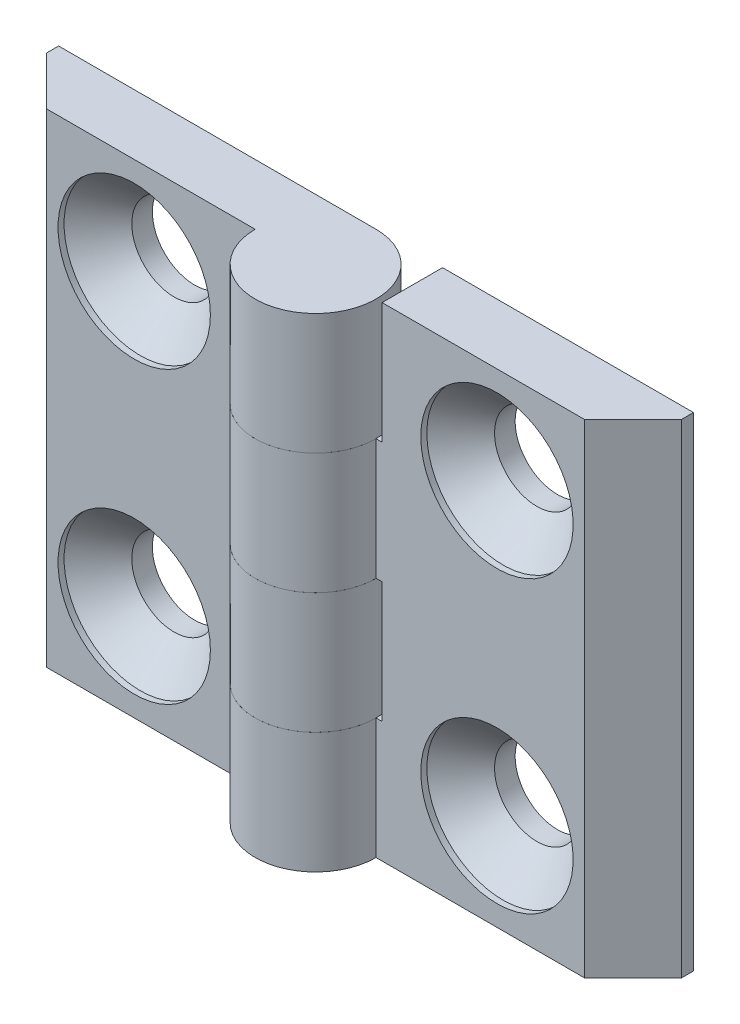
ISO-10303-21;
HEADER;
FILE_DESCRIPTION(('STEP AP214'),'2;1');
FILE_NAME('part.step','',(''),(''),'','','');
FILE_SCHEMA(('AUTOMOTIVE_DESIGN { 1 0 10303 214 1 1 1 1 }'));
ENDSEC;
DATA;
#1=APPLICATION_CONTEXT('core data for automotive mechanical design processes');
#2=APPLICATION_PROTOCOL_DEFINITION('international standard','automotive_design',2000,#1);
#3=PRODUCT_CONTEXT('',#1,'mechanical');
#4=PRODUCT('Part','Part','',(#3));
#5=PRODUCT_RELATED_PRODUCT_CATEGORY('part','',(#4));
#6=PRODUCT_DEFINITION_FORMATION('','',#4);
#7=PRODUCT_DEFINITION_CONTEXT('part definition',#1,'design');
#8=PRODUCT_DEFINITION('design','',#6,#7);
#9=PRODUCT_DEFINITION_SHAPE('','',#8);
#10=(LENGTH_UNIT() NAMED_UNIT(*) SI_UNIT(.MILLI.,.METRE.));
#11=(NAMED_UNIT(*) PLANE_ANGLE_UNIT() SI_UNIT($,.RADIAN.));
#12=(NAMED_UNIT(*) SI_UNIT($,.STERADIAN.) SOLID_ANGLE_UNIT());
#13=UNCERTAINTY_MEASURE_WITH_UNIT(LENGTH_MEASURE(1.E-05),#10,'distance_accuracy_value','');
#14=(GEOMETRIC_REPRESENTATION_CONTEXT(3) GLOBAL_UNCERTAINTY_ASSIGNED_CONTEXT((#13)) GLOBAL_UNIT_ASSIGNED_CONTEXT((#10,
#11,#12)) REPRESENTATION_CONTEXT('',''));
#15=CARTESIAN_POINT('',(0.,0.,0.));
#16=DIRECTION('',(0.,0.,1.));
#17=DIRECTION('',(1.,0.,0.));
#18=AXIS2_PLACEMENT_3D('',#15,#16,#17);
#19=CARTESIAN_POINT('',(0.,-20.,0.));
#20=DIRECTION('',(0.,1.,0.));
#21=DIRECTION('',(0.,0.,-1.));
#22=AXIS2_PLACEMENT_3D('',#19,#20,#21);
#23=CYLINDRICAL_SURFACE('',#22,5.);
#24=DIRECTION('',(0.,1.,0.));
#25=VECTOR('',#24,1.);
#26=CARTESIAN_POINT('',(5.,-20.,0.));
#27=LINE('',#26,#25);
#28=CARTESIAN_POINT('',(5.,-20.,0.));
#29=VERTEX_POINT('',#28);
#30=CARTESIAN_POINT('',(5.,-10.,0.));
#31=VERTEX_POINT('',#30);
#32=EDGE_CURVE('E194',#29,#31,#27,.T.);
#33=ORIENTED_EDGE('',*,*,#32,.T.);
#34=CARTESIAN_POINT('',(0.,-10.,0.));
#35=DIRECTION('',(0.,-1.,0.));
#36=DIRECTION('',(0.,0.,1.));
#37=AXIS2_PLACEMENT_3D('',#34,#35,#36);
#38=CIRCLE('',#37,5.);
#39=CARTESIAN_POINT('',(0.,-10.,-5.));
#40=VERTEX_POINT('',#39);
#41=EDGE_CURVE('E171',#31,#40,#38,.T.);
#42=ORIENTED_EDGE('',*,*,#41,.T.);
#43=DIRECTION('',(0.,1.,0.));
#44=VECTOR('',#43,1.);
#45=CARTESIAN_POINT('',(0.,-20.,-5.));
#46=LINE('',#45,#44);
#47=CARTESIAN_POINT('',(0.,-20.,-5.));
#48=VERTEX_POINT('',#47);
#49=EDGE_CURVE('E207',#48,#40,#46,.T.);
#50=ORIENTED_EDGE('',*,*,#49,.F.);
#51=CARTESIAN_POINT('',(0.,-20.,0.));
#52=DIRECTION('',(0.,-1.,0.));
#53=DIRECTION('',(0.,0.,1.));
#54=AXIS2_PLACEMENT_3D('',#51,#52,#53);
#55=CIRCLE('',#54,5.);
#56=EDGE_CURVE('E174',#29,#48,#55,.T.);
#57=ORIENTED_EDGE('',*,*,#56,.F.);
#58=EDGE_LOOP('',(#33,#42,#50,#57));
#59=FACE_BOUND('',#58,.T.);
#60=ADVANCED_FACE('F45',(#59),#23,.T.);
#61=CARTESIAN_POINT('',(0.,0.,-5.));
#62=VERTEX_POINT('',#61);
#63=CARTESIAN_POINT('',(0.,10.,-5.));
#64=VERTEX_POINT('',#63);
#65=EDGE_CURVE('E206',#62,#64,#46,.T.);
#66=ORIENTED_EDGE('',*,*,#65,.F.);
#67=CARTESIAN_POINT('',(0.,0.,0.));
#68=DIRECTION('',(0.,1.,0.));
#69=DIRECTION('',(0.,0.,-1.));
#70=AXIS2_PLACEMENT_3D('',#67,#68,#69);
#71=CIRCLE('',#70,5.);
#72=CARTESIAN_POINT('',(5.,0.,0.));
#73=VERTEX_POINT('',#72);
#74=EDGE_CURVE('E142',#62,#73,#71,.T.);
#75=ORIENTED_EDGE('',*,*,#74,.T.);
#76=CARTESIAN_POINT('',(5.,10.,0.));
#77=VERTEX_POINT('',#76);
#78=EDGE_CURVE('E186',#73,#77,#27,.T.);
#79=ORIENTED_EDGE('',*,*,#78,.T.);
#80=CARTESIAN_POINT('',(0.,10.,0.));
#81=DIRECTION('',(0.,-1.,0.));
#82=DIRECTION('',(1.,0.,0.));
#83=AXIS2_PLACEMENT_3D('',#80,#81,#82);
#84=CIRCLE('',#83,5.);
#85=EDGE_CURVE('E168',#77,#64,#84,.T.);
#86=ORIENTED_EDGE('',*,*,#85,.T.);
#87=EDGE_LOOP('',(#66,#75,#79,#86));
#88=FACE_BOUND('',#87,.T.);
#89=ADVANCED_FACE('F47',(#88),#23,.T.);
#90=CARTESIAN_POINT('',(0.,-20.,-5.));
#91=DIRECTION('',(0.,0.,1.));
#92=DIRECTION('',(-1.,0.,0.));
#93=AXIS2_PLACEMENT_3D('',#90,#91,#92);
#94=PLANE('',#93);
#95=CARTESIAN_POINT('',(15.,-12.,-5.00000000000011));
#96=DIRECTION('',(0.,0.,1.));
#97=DIRECTION('',(-1.,0.,0.));
#98=AXIS2_PLACEMENT_3D('',#95,#96,#97);
#99=CIRCLE('',#98,3.5);
#100=CARTESIAN_POINT('',(11.5,-12.,-5.00000000000009));
#101=VERTEX_POINT('',#100);
#102=EDGE_CURVE('E377',#101,#101,#99,.T.);
#103=ORIENTED_EDGE('',*,*,#102,.T.);
#104=EDGE_LOOP('',(#103));
#105=FACE_BOUND('',#104,.T.);
#106=CARTESIAN_POINT('',(15.,12.,-5.00000000000011));
#107=DIRECTION('',(0.,0.,1.));
#108=DIRECTION('',(-1.,0.,0.));
#109=AXIS2_PLACEMENT_3D('',#106,#107,#108);
#110=CIRCLE('',#109,3.5);
#111=CARTESIAN_POINT('',(11.5,12.,-5.00000000000009));
#112=VERTEX_POINT('',#111);
#113=EDGE_CURVE('E155',#112,#112,#110,.T.);
#114=ORIENTED_EDGE('',*,*,#113,.T.);
#115=EDGE_LOOP('',(#114));
#116=FACE_BOUND('',#115,.T.);
#117=ORIENTED_EDGE('',*,*,#49,.T.);
#118=DIRECTION('',(1.,0.,0.));
#119=VECTOR('',#118,1.);
#120=CARTESIAN_POINT('',(5.49999999999996,-10.,-5.00000000000004));
#121=LINE('',#120,#119);
#122=CARTESIAN_POINT('',(5.49999999999996,-10.,-5.00000000000004));
#123=VERTEX_POINT('',#122);
#124=EDGE_CURVE('E137',#40,#123,#121,.T.);
#125=ORIENTED_EDGE('',*,*,#124,.T.);
#126=DIRECTION('',(0.,1.,0.));
#127=VECTOR('',#126,1.);
#128=CARTESIAN_POINT('',(5.49999999999996,-10.,-5.00000000000004));
#129=LINE('',#128,#127);
#130=CARTESIAN_POINT('',(5.49999999999996,0.,-5.00000000000004));
#131=VERTEX_POINT('',#130);
#132=EDGE_CURVE('E132',#123,#131,#129,.T.);
#133=ORIENTED_EDGE('',*,*,#132,.T.);
#134=DIRECTION('',(-1.,0.,0.));
#135=VECTOR('',#134,1.);
#136=CARTESIAN_POINT('',(5.49999999999996,0.,-5.00000000000004));
#137=LINE('',#136,#135);
#138=EDGE_CURVE('E140',#131,#62,#137,.T.);
#139=ORIENTED_EDGE('',*,*,#138,.T.);
#140=ORIENTED_EDGE('',*,*,#65,.T.);
#141=DIRECTION('',(1.,0.,0.));
#142=VECTOR('',#141,1.);
#143=CARTESIAN_POINT('',(-5.00000000000004,10.,-4.99999999999996));
#144=LINE('',#143,#142);
#145=CARTESIAN_POINT('',(5.49999999999996,10.,-5.00000000000004));
#146=VERTEX_POINT('',#145);
#147=EDGE_CURVE('E160',#64,#146,#144,.T.);
#148=ORIENTED_EDGE('',*,*,#147,.T.);
#149=DIRECTION('',(0.,1.,0.));
#150=VECTOR('',#149,1.);
#151=CARTESIAN_POINT('',(5.49999999999996,20.,-5.00000000000004));
#152=LINE('',#151,#150);
#153=CARTESIAN_POINT('',(5.49999999999996,20.,-5.00000000000004));
#154=VERTEX_POINT('',#153);
#155=EDGE_CURVE('E163',#146,#154,#152,.T.);
#156=ORIENTED_EDGE('',*,*,#155,.T.);
#157=DIRECTION('',(1.,0.,0.));
#158=VECTOR('',#157,1.);
#159=CARTESIAN_POINT('',(0.,20.,-5.));
#160=LINE('',#159,#158);
#161=CARTESIAN_POINT('',(26.25,20.,-5.00000000000019));
#162=VERTEX_POINT('',#161);
#163=EDGE_CURVE('E173',#154,#162,#160,.T.);
#164=ORIENTED_EDGE('',*,*,#163,.T.);
#165=DIRECTION('',(0.,1.,0.));
#166=VECTOR('',#165,1.);
#167=CARTESIAN_POINT('',(26.25,-20.,-5.00000000000019));
#168=LINE('',#167,#166);
#169=CARTESIAN_POINT('',(26.25,-20.,-5.00000000000019));
#170=VERTEX_POINT('',#169);
#171=EDGE_CURVE('E203',#170,#162,#168,.T.);
#172=ORIENTED_EDGE('',*,*,#171,.F.);
#173=DIRECTION('',(1.,0.,0.));
#174=VECTOR('',#173,1.);
#175=CARTESIAN_POINT('',(0.,-20.,-5.));
#176=LINE('',#175,#174);
#177=EDGE_CURVE('E177',#48,#170,#176,.T.);
#178=ORIENTED_EDGE('',*,*,#177,.F.);
#179=EDGE_LOOP('',(#117,#125,#133,#139,#140,#148,#156,#164,#172,#178));
#180=FACE_BOUND('',#179,.T.);
#181=ADVANCED_FACE('F148',(#105,#116,#180),#94,.F.);
#182=CARTESIAN_POINT('',(26.25,-20.,-5.00000000000019));
#183=DIRECTION('',(-1.,0.,0.));
#184=DIRECTION('',(0.,0.,-1.));
#185=AXIS2_PLACEMENT_3D('',#182,#183,#184);
#186=PLANE('',#185);
#187=DIRECTION('',(0.,0.,1.));
#188=VECTOR('',#187,1.);
#189=CARTESIAN_POINT('',(26.25,20.,-5.00000000000019));
#190=LINE('',#189,#188);
#191=CARTESIAN_POINT('',(26.25,20.,-4.00000000000019));
#192=VERTEX_POINT('',#191);
#193=EDGE_CURVE('E188',#162,#192,#190,.T.);
#194=ORIENTED_EDGE('',*,*,#193,.T.);
#195=DIRECTION('',(0.,1.,0.));
#196=VECTOR('',#195,1.);
#197=CARTESIAN_POINT('',(26.25,-20.,-4.00000000000019));
#198=LINE('',#197,#196);
#199=CARTESIAN_POINT('',(26.25,-20.,-4.00000000000019));
#200=VERTEX_POINT('',#199);
#201=EDGE_CURVE('E200',#200,#192,#198,.T.);
#202=ORIENTED_EDGE('',*,*,#201,.F.);
#203=DIRECTION('',(0.,0.,1.));
#204=VECTOR('',#203,1.);
#205=CARTESIAN_POINT('',(26.25,-20.,-5.00000000000019));
#206=LINE('',#205,#204);
#207=EDGE_CURVE('E180',#170,#200,#206,.T.);
#208=ORIENTED_EDGE('',*,*,#207,.F.);
#209=ORIENTED_EDGE('',*,*,#171,.T.);
#210=EDGE_LOOP('',(#194,#202,#208,#209));
#211=FACE_BOUND('',#210,.T.);
#212=ADVANCED_FACE('F237',(#211),#186,.F.);
#213=CARTESIAN_POINT('',(26.25,-20.,-4.00000000000019));
#214=DIRECTION('',(-0.707106781186549,0.,-0.707106781186546));
#215=DIRECTION('',(0.707106781186546,0.,-0.707106781186549));
#216=AXIS2_PLACEMENT_3D('',#213,#214,#215);
#217=PLANE('',#216);
#218=DIRECTION('',(-0.707106781186546,0.,0.707106781186549));
#219=VECTOR('',#218,1.);
#220=CARTESIAN_POINT('',(26.25,20.,-4.00000000000019));
#221=LINE('',#220,#219);
#222=CARTESIAN_POINT('',(22.25,20.,-1.66177713162764E-13));
#223=VERTEX_POINT('',#222);
#224=EDGE_CURVE('E190',#192,#223,#221,.T.);
#225=ORIENTED_EDGE('',*,*,#224,.T.);
#226=DIRECTION('',(0.,1.,0.));
#227=VECTOR('',#226,1.);
#228=CARTESIAN_POINT('',(22.25,-20.,-1.66177713162764E-13));
#229=LINE('',#228,#227);
#230=CARTESIAN_POINT('',(22.25,-20.,-1.66177713162764E-13));
#231=VERTEX_POINT('',#230);
#232=EDGE_CURVE('E197',#231,#223,#229,.T.);
#233=ORIENTED_EDGE('',*,*,#232,.F.);
#234=DIRECTION('',(-0.707106781186546,0.,0.707106781186549));
#235=VECTOR('',#234,1.);
#236=CARTESIAN_POINT('',(26.25,-20.,-4.00000000000019));
#237=LINE('',#236,#235);
#238=EDGE_CURVE('E182',#200,#231,#237,.T.);
#239=ORIENTED_EDGE('',*,*,#238,.F.);
#240=ORIENTED_EDGE('',*,*,#201,.T.);
#241=EDGE_LOOP('',(#225,#233,#239,#240));
#242=FACE_BOUND('',#241,.T.);
#243=ADVANCED_FACE('F234',(#242),#217,.F.);
#244=CARTESIAN_POINT('',(22.25,-20.,-1.66177713162764E-13));
#245=DIRECTION('',(0.,0.,-1.));
#246=DIRECTION('',(1.,0.,0.));
#247=AXIS2_PLACEMENT_3D('',#244,#245,#246);
#248=PLANE('',#247);
#249=CARTESIAN_POINT('',(15.,-12.,-1.12309161394675E-13));
#250=DIRECTION('',(0.,0.,1.));
#251=DIRECTION('',(-1.,0.,0.));
#252=AXIS2_PLACEMENT_3D('',#249,#250,#251);
#253=CIRCLE('',#252,6.3);
#254=CARTESIAN_POINT('',(8.7,-12.,0.));
#255=VERTEX_POINT('',#254);
#256=EDGE_CURVE('E370',#255,#255,#253,.T.);
#257=ORIENTED_EDGE('',*,*,#256,.F.);
#258=EDGE_LOOP('',(#257));
#259=FACE_BOUND('',#258,.T.);
#260=CARTESIAN_POINT('',(15.,12.,-1.12309161394675E-13));
#261=DIRECTION('',(0.,0.,1.));
#262=DIRECTION('',(-1.,0.,0.));
#263=AXIS2_PLACEMENT_3D('',#260,#261,#262);
#264=CIRCLE('',#263,6.3);
#265=CARTESIAN_POINT('',(8.7,12.,0.));
#266=VERTEX_POINT('',#265);
#267=EDGE_CURVE('E379',#266,#266,#264,.T.);
#268=ORIENTED_EDGE('',*,*,#267,.F.);
#269=EDGE_LOOP('',(#268));
#270=FACE_BOUND('',#269,.T.);
#271=DIRECTION('',(0.,-1.,0.));
#272=VECTOR('',#271,1.);
#273=CARTESIAN_POINT('',(5.5,-20.,0.));
#274=LINE('',#273,#272);
#275=CARTESIAN_POINT('',(5.5,0.,0.));
#276=VERTEX_POINT('',#275);
#277=CARTESIAN_POINT('',(5.5,-10.,0.));
#278=VERTEX_POINT('',#277);
#279=EDGE_CURVE('E53',#276,#278,#274,.T.);
#280=ORIENTED_EDGE('',*,*,#279,.T.);
#281=DIRECTION('',(-1.,0.,0.));
#282=VECTOR('',#281,1.);
#283=CARTESIAN_POINT('',(22.25,-10.,-1.66177713162764E-13));
#284=LINE('',#283,#282);
#285=EDGE_CURVE('E12',#278,#31,#284,.T.);
#286=ORIENTED_EDGE('',*,*,#285,.T.);
#287=ORIENTED_EDGE('',*,*,#32,.F.);
#288=DIRECTION('',(-1.,0.,0.));
#289=VECTOR('',#288,1.);
#290=CARTESIAN_POINT('',(22.25,-20.,-1.66177713162764E-13));
#291=LINE('',#290,#289);
#292=EDGE_CURVE('E184',#231,#29,#291,.T.);
#293=ORIENTED_EDGE('',*,*,#292,.F.);
#294=ORIENTED_EDGE('',*,*,#232,.T.);
#295=DIRECTION('',(-1.,0.,0.));
#296=VECTOR('',#295,1.);
#297=CARTESIAN_POINT('',(22.25,20.,-1.66177713162764E-13));
#298=LINE('',#297,#296);
#299=CARTESIAN_POINT('',(5.5,20.,0.));
#300=VERTEX_POINT('',#299);
#301=EDGE_CURVE('E178',#223,#300,#298,.T.);
#302=ORIENTED_EDGE('',*,*,#301,.T.);
#303=DIRECTION('',(0.,-1.,0.));
#304=VECTOR('',#303,1.);
#305=CARTESIAN_POINT('',(5.49999999999999,-20.,0.));
#306=LINE('',#305,#304);
#307=CARTESIAN_POINT('',(5.5,10.,0.));
#308=VERTEX_POINT('',#307);
#309=EDGE_CURVE('E68',#300,#308,#306,.T.);
#310=ORIENTED_EDGE('',*,*,#309,.T.);
#311=DIRECTION('',(-1.,0.,0.));
#312=VECTOR('',#311,1.);
#313=CARTESIAN_POINT('',(22.25,10.,-1.66177713162764E-13));
#314=LINE('',#313,#312);
#315=EDGE_CURVE('E209',#308,#77,#314,.T.);
#316=ORIENTED_EDGE('',*,*,#315,.T.);
#317=ORIENTED_EDGE('',*,*,#78,.F.);
#318=DIRECTION('',(1.,0.,0.));
#319=VECTOR('',#318,1.);
#320=CARTESIAN_POINT('',(22.25,0.,-1.66177713162764E-13));
#321=LINE('',#320,#319);
#322=EDGE_CURVE('E212',#73,#276,#321,.T.);
#323=ORIENTED_EDGE('',*,*,#322,.T.);
#324=EDGE_LOOP('',(#280,#286,#287,#293,#294,#302,#310,#316,#317,#323));
#325=FACE_BOUND('',#324,.T.);
#326=ADVANCED_FACE('F214',(#259,#270,#325),#248,.F.);
#327=CARTESIAN_POINT('',(0.,-20.,0.));
#328=DIRECTION('',(0.,-1.,0.));
#329=DIRECTION('',(0.,0.,1.));
#330=AXIS2_PLACEMENT_3D('',#327,#328,#329);
#331=PLANE('',#330);
#332=ORIENTED_EDGE('',*,*,#56,.T.);
#333=ORIENTED_EDGE('',*,*,#177,.T.);
#334=ORIENTED_EDGE('',*,*,#207,.T.);
#335=ORIENTED_EDGE('',*,*,#238,.T.);
#336=ORIENTED_EDGE('',*,*,#292,.T.);
#337=EDGE_LOOP('',(#332,#333,#334,#335,#336));
#338=FACE_BOUND('',#337,.T.);
#339=ADVANCED_FACE('F243',(#338),#331,.T.);
#340=CARTESIAN_POINT('',(0.,20.,0.));
#341=DIRECTION('',(0.,-1.,0.));
#342=DIRECTION('',(0.,0.,1.));
#343=AXIS2_PLACEMENT_3D('',#340,#341,#342);
#344=PLANE('',#343);
#345=ORIENTED_EDGE('',*,*,#163,.F.);
#346=DIRECTION('',(0.,0.,1.));
#347=VECTOR('',#346,1.);
#348=CARTESIAN_POINT('',(5.49999999999996,20.,-5.00000000000004));
#349=LINE('',#348,#347);
#350=EDGE_CURVE('E150',#154,#300,#349,.T.);
#351=ORIENTED_EDGE('',*,*,#350,.T.);
#352=ORIENTED_EDGE('',*,*,#301,.F.);
#353=ORIENTED_EDGE('',*,*,#224,.F.);
#354=ORIENTED_EDGE('',*,*,#193,.F.);
#355=EDGE_LOOP('',(#345,#351,#352,#353,#354));
#356=FACE_BOUND('',#355,.T.);
#357=ADVANCED_FACE('F227',(#356),#344,.F.);
#358=CARTESIAN_POINT('',(-5.00000000000004,10.,-4.99999999999996));
#359=DIRECTION('',(0.,-1.,0.));
#360=DIRECTION('',(1.,0.,0.));
#361=AXIS2_PLACEMENT_3D('',#358,#359,#360);
#362=PLANE('',#361);
#363=ORIENTED_EDGE('',*,*,#85,.F.);
#364=ORIENTED_EDGE('',*,*,#315,.F.);
#365=DIRECTION('',(0.,0.,1.));
#366=VECTOR('',#365,1.);
#367=CARTESIAN_POINT('',(5.49999999999996,10.,-5.00000000000004));
#368=LINE('',#367,#366);
#369=EDGE_CURVE('E152',#146,#308,#368,.T.);
#370=ORIENTED_EDGE('',*,*,#369,.F.);
#371=ORIENTED_EDGE('',*,*,#147,.F.);
#372=EDGE_LOOP('',(#363,#364,#370,#371));
#373=FACE_BOUND('',#372,.T.);
#374=ADVANCED_FACE('F223',(#373),#362,.F.);
#375=CARTESIAN_POINT('',(5.49999999999996,20.,-5.00000000000004));
#376=DIRECTION('',(1.,0.,0.));
#377=DIRECTION('',(0.,1.,0.));
#378=AXIS2_PLACEMENT_3D('',#375,#376,#377);
#379=PLANE('',#378);
#380=ORIENTED_EDGE('',*,*,#350,.F.);
#381=ORIENTED_EDGE('',*,*,#155,.F.);
#382=ORIENTED_EDGE('',*,*,#369,.T.);
#383=ORIENTED_EDGE('',*,*,#309,.F.);
#384=EDGE_LOOP('',(#380,#381,#382,#383));
#385=FACE_BOUND('',#384,.T.);
#386=ADVANCED_FACE('F224',(#385),#379,.F.);
#387=CARTESIAN_POINT('',(5.49999999999996,-10.,-5.00000000000004));
#388=DIRECTION('',(1.,0.,0.));
#389=DIRECTION('',(0.,1.,0.));
#390=AXIS2_PLACEMENT_3D('',#387,#388,#389);
#391=PLANE('',#390);
#392=DIRECTION('',(0.,0.,1.));
#393=VECTOR('',#392,1.);
#394=CARTESIAN_POINT('',(5.49999999999996,0.,-5.00000000000004));
#395=LINE('',#394,#393);
#396=EDGE_CURVE('E60',#131,#276,#395,.T.);
#397=ORIENTED_EDGE('',*,*,#396,.F.);
#398=ORIENTED_EDGE('',*,*,#132,.F.);
#399=DIRECTION('',(0.,0.,1.));
#400=VECTOR('',#399,1.);
#401=CARTESIAN_POINT('',(5.49999999999996,-10.,-5.00000000000004));
#402=LINE('',#401,#400);
#403=EDGE_CURVE('E136',#123,#278,#402,.T.);
#404=ORIENTED_EDGE('',*,*,#403,.T.);
#405=ORIENTED_EDGE('',*,*,#279,.F.);
#406=EDGE_LOOP('',(#397,#398,#404,#405));
#407=FACE_BOUND('',#406,.T.);
#408=ADVANCED_FACE('F129',(#407),#391,.F.);
#409=CARTESIAN_POINT('',(5.49999999999996,-10.,-5.00000000000004));
#410=DIRECTION('',(0.,-1.,0.));
#411=DIRECTION('',(0.,0.,1.));
#412=AXIS2_PLACEMENT_3D('',#409,#410,#411);
#413=PLANE('',#412);
#414=ORIENTED_EDGE('',*,*,#41,.F.);
#415=ORIENTED_EDGE('',*,*,#285,.F.);
#416=ORIENTED_EDGE('',*,*,#403,.F.);
#417=ORIENTED_EDGE('',*,*,#124,.F.);
#418=EDGE_LOOP('',(#414,#415,#416,#417));
#419=FACE_BOUND('',#418,.T.);
#420=ADVANCED_FACE('F246',(#419),#413,.F.);
#421=CARTESIAN_POINT('',(5.49999999999996,0.,-5.00000000000004));
#422=DIRECTION('',(0.,1.,0.));
#423=DIRECTION('',(0.,0.,-1.));
#424=AXIS2_PLACEMENT_3D('',#421,#422,#423);
#425=PLANE('',#424);
#426=ORIENTED_EDGE('',*,*,#138,.F.);
#427=ORIENTED_EDGE('',*,*,#396,.T.);
#428=ORIENTED_EDGE('',*,*,#322,.F.);
#429=ORIENTED_EDGE('',*,*,#74,.F.);
#430=EDGE_LOOP('',(#426,#427,#428,#429));
#431=FACE_BOUND('',#430,.T.);
#432=ADVANCED_FACE('F141',(#431),#425,.F.);
#433=CARTESIAN_POINT('',(15.,12.,-1.12092320960178E-13));
#434=DIRECTION('',(0.,0.,1.));
#435=DIRECTION('',(-1.,0.,0.));
#436=AXIS2_PLACEMENT_3D('',#433,#434,#435);
#437=CYLINDRICAL_SURFACE('',#436,3.5);
#438=ORIENTED_EDGE('',*,*,#113,.F.);
#439=EDGE_LOOP('',(#438));
#440=FACE_BOUND('',#439,.T.);
#441=CARTESIAN_POINT('',(15.,12.,-3.30000000000011));
#442=DIRECTION('',(0.,0.,1.));
#443=DIRECTION('',(-1.,0.,0.));
#444=AXIS2_PLACEMENT_3D('',#441,#442,#443);
#445=CIRCLE('',#444,3.5);
#446=CARTESIAN_POINT('',(11.5,12.,-3.30000000000008));
#447=VERTEX_POINT('',#446);
#448=EDGE_CURVE('E384',#447,#447,#445,.T.);
#449=ORIENTED_EDGE('',*,*,#448,.T.);
#450=EDGE_LOOP('',(#449));
#451=FACE_BOUND('',#450,.T.);
#452=ADVANCED_FACE('F253',(#440,#451),#437,.F.);
#453=CARTESIAN_POINT('',(15.,12.,-0.500000000000112));
#454=DIRECTION('',(0.,0.,1.));
#455=DIRECTION('',(-1.,0.,0.));
#456=AXIS2_PLACEMENT_3D('',#453,#454,#455);
#457=CONICAL_SURFACE('',#456,6.3,0.785398163397449);
#458=ORIENTED_EDGE('',*,*,#448,.F.);
#459=EDGE_LOOP('',(#458));
#460=FACE_BOUND('',#459,.T.);
#461=CARTESIAN_POINT('',(15.,12.,-0.500000000000112));
#462=DIRECTION('',(0.,0.,1.));
#463=DIRECTION('',(-1.,0.,0.));
#464=AXIS2_PLACEMENT_3D('',#461,#462,#463);
#465=CIRCLE('',#464,6.3);
#466=CARTESIAN_POINT('',(8.69999999999999,12.,-0.500000000000065));
#467=VERTEX_POINT('',#466);
#468=EDGE_CURVE('E382',#467,#467,#465,.T.);
#469=ORIENTED_EDGE('',*,*,#468,.T.);
#470=EDGE_LOOP('',(#469));
#471=FACE_BOUND('',#470,.T.);
#472=ADVANCED_FACE('F311',(#460,#471),#457,.F.);
#473=CARTESIAN_POINT('',(15.,12.,-1.12092320960178E-13));
#474=DIRECTION('',(0.,0.,1.));
#475=DIRECTION('',(-1.,0.,0.));
#476=AXIS2_PLACEMENT_3D('',#473,#474,#475);
#477=CYLINDRICAL_SURFACE('',#476,6.3);
#478=ORIENTED_EDGE('',*,*,#468,.F.);
#479=EDGE_LOOP('',(#478));
#480=FACE_BOUND('',#479,.T.);
#481=ORIENTED_EDGE('',*,*,#267,.T.);
#482=EDGE_LOOP('',(#481));
#483=FACE_BOUND('',#482,.T.);
#484=ADVANCED_FACE('F320',(#480,#483),#477,.F.);
#485=CARTESIAN_POINT('',(15.,-12.,-1.12092320960178E-13));
#486=DIRECTION('',(0.,0.,1.));
#487=DIRECTION('',(-1.,0.,0.));
#488=AXIS2_PLACEMENT_3D('',#485,#486,#487);
#489=CYLINDRICAL_SURFACE('',#488,3.5);
#490=ORIENTED_EDGE('',*,*,#102,.F.);
#491=EDGE_LOOP('',(#490));
#492=FACE_BOUND('',#491,.T.);
#493=CARTESIAN_POINT('',(15.,-12.,-3.30000000000011));
#494=DIRECTION('',(0.,0.,1.));
#495=DIRECTION('',(-1.,0.,0.));
#496=AXIS2_PLACEMENT_3D('',#493,#494,#495);
#497=CIRCLE('',#496,3.5);
#498=CARTESIAN_POINT('',(11.5,-12.,-3.30000000000008));
#499=VERTEX_POINT('',#498);
#500=EDGE_CURVE('E372',#499,#499,#497,.T.);
#501=ORIENTED_EDGE('',*,*,#500,.T.);
#502=EDGE_LOOP('',(#501));
#503=FACE_BOUND('',#502,.T.);
#504=ADVANCED_FACE('F330',(#492,#503),#489,.F.);
#505=CARTESIAN_POINT('',(15.,-12.,-0.500000000000112));
#506=DIRECTION('',(0.,0.,1.));
#507=DIRECTION('',(-1.,0.,0.));
#508=AXIS2_PLACEMENT_3D('',#505,#506,#507);
#509=CONICAL_SURFACE('',#508,6.3,0.785398163397449);
#510=ORIENTED_EDGE('',*,*,#500,.F.);
#511=EDGE_LOOP('',(#510));
#512=FACE_BOUND('',#511,.T.);
#513=CARTESIAN_POINT('',(15.,-12.,-0.500000000000112));
#514=DIRECTION('',(0.,0.,1.));
#515=DIRECTION('',(-1.,0.,0.));
#516=AXIS2_PLACEMENT_3D('',#513,#514,#515);
#517=CIRCLE('',#516,6.3);
#518=CARTESIAN_POINT('',(8.69999999999999,-12.,-0.500000000000065));
#519=VERTEX_POINT('',#518);
#520=EDGE_CURVE('E367',#519,#519,#517,.T.);
#521=ORIENTED_EDGE('',*,*,#520,.T.);
#522=EDGE_LOOP('',(#521));
#523=FACE_BOUND('',#522,.T.);
#524=ADVANCED_FACE('F340',(#512,#523),#509,.F.);
#525=CARTESIAN_POINT('',(15.,-12.,-1.12092320960178E-13));
#526=DIRECTION('',(0.,0.,1.));
#527=DIRECTION('',(-1.,0.,0.));
#528=AXIS2_PLACEMENT_3D('',#525,#526,#527);
#529=CYLINDRICAL_SURFACE('',#528,6.3);
#530=ORIENTED_EDGE('',*,*,#520,.F.);
#531=EDGE_LOOP('',(#530));
#532=FACE_BOUND('',#531,.T.);
#533=ORIENTED_EDGE('',*,*,#256,.T.);
#534=EDGE_LOOP('',(#533));
#535=FACE_BOUND('',#534,.T.);
#536=ADVANCED_FACE('F350',(#532,#535),#529,.F.);
#537=CLOSED_SHELL('',(#60,#89,#181,#212,#243,#326,#339,#357,#374,#386,#408,#420,#432,#452,#472,
#484,#504,#524,#536));
#538=MANIFOLD_SOLID_BREP('B2',#537);
#539=CARTESIAN_POINT('',(0.,20.,0.));
#540=DIRECTION('',(0.,-1.,0.));
#541=DIRECTION('',(0.,0.,-1.));
#542=AXIS2_PLACEMENT_3D('',#539,#540,#541);
#543=CYLINDRICAL_SURFACE('',#542,5.);
#544=DIRECTION('',(0.,-1.,0.));
#545=VECTOR('',#544,1.);
#546=CARTESIAN_POINT('',(-5.,20.,0.));
#547=LINE('',#546,#545);
#548=CARTESIAN_POINT('',(-5.,20.,0.));
#549=VERTEX_POINT('',#548);
#550=CARTESIAN_POINT('',(-5.,10.,0.));
#551=VERTEX_POINT('',#550);
#552=EDGE_CURVE('E599',#549,#551,#547,.T.);
#553=ORIENTED_EDGE('',*,*,#552,.T.);
#554=CARTESIAN_POINT('',(0.,10.,0.));
#555=DIRECTION('',(0.,1.,0.));
#556=DIRECTION('',(0.,0.,1.));
#557=AXIS2_PLACEMENT_3D('',#554,#555,#556);
#558=CIRCLE('',#557,5.);
#559=CARTESIAN_POINT('',(0.,10.,-5.));
#560=VERTEX_POINT('',#559);
#561=EDGE_CURVE('E576',#551,#560,#558,.T.);
#562=ORIENTED_EDGE('',*,*,#561,.T.);
#563=DIRECTION('',(0.,-1.,0.));
#564=VECTOR('',#563,1.);
#565=CARTESIAN_POINT('',(0.,20.,-5.));
#566=LINE('',#565,#564);
#567=CARTESIAN_POINT('',(0.,20.,-5.));
#568=VERTEX_POINT('',#567);
#569=EDGE_CURVE('E612',#568,#560,#566,.T.);
#570=ORIENTED_EDGE('',*,*,#569,.F.);
#571=CARTESIAN_POINT('',(0.,20.,0.));
#572=DIRECTION('',(0.,1.,0.));
#573=DIRECTION('',(0.,0.,1.));
#574=AXIS2_PLACEMENT_3D('',#571,#572,#573);
#575=CIRCLE('',#574,5.);
#576=EDGE_CURVE('E579',#549,#568,#575,.T.);
#577=ORIENTED_EDGE('',*,*,#576,.F.);
#578=EDGE_LOOP('',(#553,#562,#570,#577));
#579=FACE_BOUND('',#578,.T.);
#580=ADVANCED_FACE('F450',(#579),#543,.T.);
#581=CARTESIAN_POINT('',(0.,0.,-5.));
#582=VERTEX_POINT('',#581);
#583=CARTESIAN_POINT('',(0.,-10.,-5.));
#584=VERTEX_POINT('',#583);
#585=EDGE_CURVE('E611',#582,#584,#566,.T.);
#586=ORIENTED_EDGE('',*,*,#585,.F.);
#587=CARTESIAN_POINT('',(0.,0.,0.));
#588=DIRECTION('',(0.,-1.,0.));
#589=DIRECTION('',(0.,0.,-1.));
#590=AXIS2_PLACEMENT_3D('',#587,#588,#589);
#591=CIRCLE('',#590,5.);
#592=CARTESIAN_POINT('',(-5.,0.,0.));
#593=VERTEX_POINT('',#592);
#594=EDGE_CURVE('E547',#582,#593,#591,.T.);
#595=ORIENTED_EDGE('',*,*,#594,.T.);
#596=CARTESIAN_POINT('',(-5.,-10.,0.));
#597=VERTEX_POINT('',#596);
#598=EDGE_CURVE('E591',#593,#597,#547,.T.);
#599=ORIENTED_EDGE('',*,*,#598,.T.);
#600=CARTESIAN_POINT('',(0.,-10.,0.));
#601=DIRECTION('',(0.,1.,0.));
#602=DIRECTION('',(-1.,0.,0.));
#603=AXIS2_PLACEMENT_3D('',#600,#601,#602);
#604=CIRCLE('',#603,5.);
#605=EDGE_CURVE('E573',#597,#584,#604,.T.);
#606=ORIENTED_EDGE('',*,*,#605,.T.);
#607=EDGE_LOOP('',(#586,#595,#599,#606));
#608=FACE_BOUND('',#607,.T.);
#609=ADVANCED_FACE('F452',(#608),#543,.T.);
#610=CARTESIAN_POINT('',(0.,20.,-5.));
#611=DIRECTION('',(0.,0.,1.));
#612=DIRECTION('',(1.,0.,0.));
#613=AXIS2_PLACEMENT_3D('',#610,#611,#612);
#614=PLANE('',#613);
#615=CARTESIAN_POINT('',(-15.,12.,-5.));
#616=DIRECTION('',(0.,0.,1.));
#617=DIRECTION('',(1.,0.,0.));
#618=AXIS2_PLACEMENT_3D('',#615,#616,#617);
#619=CIRCLE('',#618,3.5);
#620=CARTESIAN_POINT('',(-11.5,12.,-5.));
#621=VERTEX_POINT('',#620);
#622=EDGE_CURVE('E796',#621,#621,#619,.T.);
#623=ORIENTED_EDGE('',*,*,#622,.T.);
#624=EDGE_LOOP('',(#623));
#625=FACE_BOUND('',#624,.T.);
#626=CARTESIAN_POINT('',(-15.,-12.,-5.));
#627=DIRECTION('',(0.,0.,1.));
#628=DIRECTION('',(1.,0.,0.));
#629=AXIS2_PLACEMENT_3D('',#626,#627,#628);
#630=CIRCLE('',#629,3.5);
#631=CARTESIAN_POINT('',(-11.5,-12.,-5.));
#632=VERTEX_POINT('',#631);
#633=EDGE_CURVE('E560',#632,#632,#630,.T.);
#634=ORIENTED_EDGE('',*,*,#633,.T.);
#635=EDGE_LOOP('',(#634));
#636=FACE_BOUND('',#635,.T.);
#637=ORIENTED_EDGE('',*,*,#569,.T.);
#638=DIRECTION('',(-1.,0.,0.));
#639=VECTOR('',#638,1.);
#640=CARTESIAN_POINT('',(-5.5,10.,-5.));
#641=LINE('',#640,#639);
#642=CARTESIAN_POINT('',(-5.5,10.,-5.));
#643=VERTEX_POINT('',#642);
#644=EDGE_CURVE('E542',#560,#643,#641,.T.);
#645=ORIENTED_EDGE('',*,*,#644,.T.);
#646=DIRECTION('',(0.,-1.,0.));
#647=VECTOR('',#646,1.);
#648=CARTESIAN_POINT('',(-5.5,10.,-5.));
#649=LINE('',#648,#647);
#650=CARTESIAN_POINT('',(-5.5,0.,-5.));
#651=VERTEX_POINT('',#650);
#652=EDGE_CURVE('E537',#643,#651,#649,.T.);
#653=ORIENTED_EDGE('',*,*,#652,.T.);
#654=DIRECTION('',(1.,0.,0.));
#655=VECTOR('',#654,1.);
#656=CARTESIAN_POINT('',(-5.5,0.,-5.));
#657=LINE('',#656,#655);
#658=EDGE_CURVE('E545',#651,#582,#657,.T.);
#659=ORIENTED_EDGE('',*,*,#658,.T.);
#660=ORIENTED_EDGE('',*,*,#585,.T.);
#661=DIRECTION('',(-1.,0.,0.));
#662=VECTOR('',#661,1.);
#663=CARTESIAN_POINT('',(5.,-10.,-5.));
#664=LINE('',#663,#662);
#665=CARTESIAN_POINT('',(-5.5,-10.,-5.));
#666=VERTEX_POINT('',#665);
#667=EDGE_CURVE('E565',#584,#666,#664,.T.);
#668=ORIENTED_EDGE('',*,*,#667,.T.);
#669=DIRECTION('',(0.,-1.,0.));
#670=VECTOR('',#669,1.);
#671=CARTESIAN_POINT('',(-5.5,-20.,-5.));
#672=LINE('',#671,#670);
#673=CARTESIAN_POINT('',(-5.5,-20.,-5.));
#674=VERTEX_POINT('',#673);
#675=EDGE_CURVE('E568',#666,#674,#672,.T.);
#676=ORIENTED_EDGE('',*,*,#675,.T.);
#677=DIRECTION('',(-1.,0.,0.));
#678=VECTOR('',#677,1.);
#679=CARTESIAN_POINT('',(0.,-20.,-5.));
#680=LINE('',#679,#678);
#681=CARTESIAN_POINT('',(-26.25,-20.,-5.));
#682=VERTEX_POINT('',#681);
#683=EDGE_CURVE('E578',#674,#682,#680,.T.);
#684=ORIENTED_EDGE('',*,*,#683,.T.);
#685=DIRECTION('',(0.,-1.,0.));
#686=VECTOR('',#685,1.);
#687=CARTESIAN_POINT('',(-26.25,20.,-5.));
#688=LINE('',#687,#686);
#689=CARTESIAN_POINT('',(-26.25,20.,-5.));
#690=VERTEX_POINT('',#689);
#691=EDGE_CURVE('E608',#690,#682,#688,.T.);
#692=ORIENTED_EDGE('',*,*,#691,.F.);
#693=DIRECTION('',(-1.,0.,0.));
#694=VECTOR('',#693,1.);
#695=CARTESIAN_POINT('',(0.,20.,-5.));
#696=LINE('',#695,#694);
#697=EDGE_CURVE('E582',#568,#690,#696,.T.);
#698=ORIENTED_EDGE('',*,*,#697,.F.);
#699=EDGE_LOOP('',(#637,#645,#653,#659,#660,#668,#676,#684,#692,#698));
#700=FACE_BOUND('',#699,.T.);
#701=ADVANCED_FACE('F553',(#625,#636,#700),#614,.F.);
#702=CARTESIAN_POINT('',(-26.25,20.,-5.));
#703=DIRECTION('',(1.,0.,0.));
#704=DIRECTION('',(0.,0.,-1.));
#705=AXIS2_PLACEMENT_3D('',#702,#703,#704);
#706=PLANE('',#705);
#707=DIRECTION('',(0.,0.,1.));
#708=VECTOR('',#707,1.);
#709=CARTESIAN_POINT('',(-26.25,-20.,-5.));
#710=LINE('',#709,#708);
#711=CARTESIAN_POINT('',(-26.25,-20.,-4.));
#712=VERTEX_POINT('',#711);
#713=EDGE_CURVE('E593',#682,#712,#710,.T.);
#714=ORIENTED_EDGE('',*,*,#713,.T.);
#715=DIRECTION('',(0.,-1.,0.));
#716=VECTOR('',#715,1.);
#717=CARTESIAN_POINT('',(-26.25,20.,-4.));
#718=LINE('',#717,#716);
#719=CARTESIAN_POINT('',(-26.25,20.,-4.));
#720=VERTEX_POINT('',#719);
#721=EDGE_CURVE('E605',#720,#712,#718,.T.);
#722=ORIENTED_EDGE('',*,*,#721,.F.);
#723=DIRECTION('',(0.,0.,1.));
#724=VECTOR('',#723,1.);
#725=CARTESIAN_POINT('',(-26.25,20.,-5.));
#726=LINE('',#725,#724);
#727=EDGE_CURVE('E585',#690,#720,#726,.T.);
#728=ORIENTED_EDGE('',*,*,#727,.F.);
#729=ORIENTED_EDGE('',*,*,#691,.T.);
#730=EDGE_LOOP('',(#714,#722,#728,#729));
#731=FACE_BOUND('',#730,.T.);
#732=ADVANCED_FACE('F642',(#731),#706,.F.);
#733=CARTESIAN_POINT('',(-26.25,20.,-4.));
#734=DIRECTION('',(0.707106781186544,0.,-0.707106781186552));
#735=DIRECTION('',(-0.707106781186551,0.,-0.707106781186544));
#736=AXIS2_PLACEMENT_3D('',#733,#734,#735);
#737=PLANE('',#736);
#738=DIRECTION('',(0.707106781186552,0.,0.707106781186544));
#739=VECTOR('',#738,1.);
#740=CARTESIAN_POINT('',(-26.25,-20.,-4.));
#741=LINE('',#740,#739);
#742=CARTESIAN_POINT('',(-22.25,-20.,0.));
#743=VERTEX_POINT('',#742);
#744=EDGE_CURVE('E595',#712,#743,#741,.T.);
#745=ORIENTED_EDGE('',*,*,#744,.T.);
#746=DIRECTION('',(0.,-1.,0.));
#747=VECTOR('',#746,1.);
#748=CARTESIAN_POINT('',(-22.25,20.,0.));
#749=LINE('',#748,#747);
#750=CARTESIAN_POINT('',(-22.25,20.,0.));
#751=VERTEX_POINT('',#750);
#752=EDGE_CURVE('E602',#751,#743,#749,.T.);
#753=ORIENTED_EDGE('',*,*,#752,.F.);
#754=DIRECTION('',(0.707106781186552,0.,0.707106781186544));
#755=VECTOR('',#754,1.);
#756=CARTESIAN_POINT('',(-26.25,20.,-4.));
#757=LINE('',#756,#755);
#758=EDGE_CURVE('E587',#720,#751,#757,.T.);
#759=ORIENTED_EDGE('',*,*,#758,.F.);
#760=ORIENTED_EDGE('',*,*,#721,.T.);
#761=EDGE_LOOP('',(#745,#753,#759,#760));
#762=FACE_BOUND('',#761,.T.);
#763=ADVANCED_FACE('F639',(#762),#737,.F.);
#764=CARTESIAN_POINT('',(-22.25,20.,0.));
#765=DIRECTION('',(0.,0.,-1.));
#766=DIRECTION('',(-1.,0.,0.));
#767=AXIS2_PLACEMENT_3D('',#764,#765,#766);
#768=PLANE('',#767);
#769=CARTESIAN_POINT('',(-15.,12.,0.));
#770=DIRECTION('',(0.,0.,1.));
#771=DIRECTION('',(1.,0.,0.));
#772=AXIS2_PLACEMENT_3D('',#769,#770,#771);
#773=CIRCLE('',#772,6.3);
#774=CARTESIAN_POINT('',(-8.7,12.,0.));
#775=VERTEX_POINT('',#774);
#776=EDGE_CURVE('E789',#775,#775,#773,.T.);
#777=ORIENTED_EDGE('',*,*,#776,.F.);
#778=EDGE_LOOP('',(#777));
#779=FACE_BOUND('',#778,.T.);
#780=CARTESIAN_POINT('',(-15.,-12.,0.));
#781=DIRECTION('',(0.,0.,1.));
#782=DIRECTION('',(1.,0.,0.));
#783=AXIS2_PLACEMENT_3D('',#780,#781,#782);
#784=CIRCLE('',#783,6.3);
#785=CARTESIAN_POINT('',(-8.7,-12.,0.));
#786=VERTEX_POINT('',#785);
#787=EDGE_CURVE('E798',#786,#786,#784,.T.);
#788=ORIENTED_EDGE('',*,*,#787,.F.);
#789=EDGE_LOOP('',(#788));
#790=FACE_BOUND('',#789,.T.);
#791=DIRECTION('',(0.,1.,0.));
#792=VECTOR('',#791,1.);
#793=CARTESIAN_POINT('',(-5.5,20.,0.));
#794=LINE('',#793,#792);
#795=CARTESIAN_POINT('',(-5.5,0.,0.));
#796=VERTEX_POINT('',#795);
#797=CARTESIAN_POINT('',(-5.5,10.,0.));
#798=VERTEX_POINT('',#797);
#799=EDGE_CURVE('E458',#796,#798,#794,.T.);
#800=ORIENTED_EDGE('',*,*,#799,.T.);
#801=DIRECTION('',(1.,0.,0.));
#802=VECTOR('',#801,1.);
#803=CARTESIAN_POINT('',(-22.25,10.,0.));
#804=LINE('',#803,#802);
#805=EDGE_CURVE('E43',#798,#551,#804,.T.);
#806=ORIENTED_EDGE('',*,*,#805,.T.);
#807=ORIENTED_EDGE('',*,*,#552,.F.);
#808=DIRECTION('',(1.,0.,0.));
#809=VECTOR('',#808,1.);
#810=CARTESIAN_POINT('',(-22.25,20.,0.));
#811=LINE('',#810,#809);
#812=EDGE_CURVE('E589',#751,#549,#811,.T.);
#813=ORIENTED_EDGE('',*,*,#812,.F.);
#814=ORIENTED_EDGE('',*,*,#752,.T.);
#815=DIRECTION('',(1.,0.,0.));
#816=VECTOR('',#815,1.);
#817=CARTESIAN_POINT('',(-22.25,-20.,0.));
#818=LINE('',#817,#816);
#819=CARTESIAN_POINT('',(-5.5,-20.,0.));
#820=VERTEX_POINT('',#819);
#821=EDGE_CURVE('E583',#743,#820,#818,.T.);
#822=ORIENTED_EDGE('',*,*,#821,.T.);
#823=DIRECTION('',(0.,1.,0.));
#824=VECTOR('',#823,1.);
#825=CARTESIAN_POINT('',(-5.49999999999999,20.,0.));
#826=LINE('',#825,#824);
#827=CARTESIAN_POINT('',(-5.5,-10.,0.));
#828=VERTEX_POINT('',#827);
#829=EDGE_CURVE('E473',#820,#828,#826,.T.);
#830=ORIENTED_EDGE('',*,*,#829,.T.);
#831=DIRECTION('',(1.,0.,0.));
#832=VECTOR('',#831,1.);
#833=CARTESIAN_POINT('',(-22.25,-10.,0.));
#834=LINE('',#833,#832);
#835=EDGE_CURVE('E614',#828,#597,#834,.T.);
#836=ORIENTED_EDGE('',*,*,#835,.T.);
#837=ORIENTED_EDGE('',*,*,#598,.F.);
#838=DIRECTION('',(-1.,0.,0.));
#839=VECTOR('',#838,1.);
#840=CARTESIAN_POINT('',(-22.25,0.,0.));
#841=LINE('',#840,#839);
#842=EDGE_CURVE('E617',#593,#796,#841,.T.);
#843=ORIENTED_EDGE('',*,*,#842,.T.);
#844=EDGE_LOOP('',(#800,#806,#807,#813,#814,#822,#830,#836,#837,#843));
#845=FACE_BOUND('',#844,.T.);
#846=ADVANCED_FACE('F619',(#779,#790,#845),#768,.F.);
#847=CARTESIAN_POINT('',(0.,20.,0.));
#848=DIRECTION('',(0.,1.,0.));
#849=DIRECTION('',(0.,0.,1.));
#850=AXIS2_PLACEMENT_3D('',#847,#848,#849);
#851=PLANE('',#850);
#852=ORIENTED_EDGE('',*,*,#576,.T.);
#853=ORIENTED_EDGE('',*,*,#697,.T.);
#854=ORIENTED_EDGE('',*,*,#727,.T.);
#855=ORIENTED_EDGE('',*,*,#758,.T.);
#856=ORIENTED_EDGE('',*,*,#812,.T.);
#857=EDGE_LOOP('',(#852,#853,#854,#855,#856));
#858=FACE_BOUND('',#857,.T.);
#859=ADVANCED_FACE('F648',(#858),#851,.T.);
#860=CARTESIAN_POINT('',(0.,-20.,0.));
#861=DIRECTION('',(0.,1.,0.));
#862=DIRECTION('',(0.,0.,1.));
#863=AXIS2_PLACEMENT_3D('',#860,#861,#862);
#864=PLANE('',#863);
#865=ORIENTED_EDGE('',*,*,#683,.F.);
#866=DIRECTION('',(0.,0.,1.));
#867=VECTOR('',#866,1.);
#868=CARTESIAN_POINT('',(-5.5,-20.,-5.));
#869=LINE('',#868,#867);
#870=EDGE_CURVE('E555',#674,#820,#869,.T.);
#871=ORIENTED_EDGE('',*,*,#870,.T.);
#872=ORIENTED_EDGE('',*,*,#821,.F.);
#873=ORIENTED_EDGE('',*,*,#744,.F.);
#874=ORIENTED_EDGE('',*,*,#713,.F.);
#875=EDGE_LOOP('',(#865,#871,#872,#873,#874));
#876=FACE_BOUND('',#875,.T.);
#877=ADVANCED_FACE('F632',(#876),#864,.F.);
#878=CARTESIAN_POINT('',(5.,-10.,-5.));
#879=DIRECTION('',(0.,1.,0.));
#880=DIRECTION('',(-1.,0.,0.));
#881=AXIS2_PLACEMENT_3D('',#878,#879,#880);
#882=PLANE('',#881);
#883=ORIENTED_EDGE('',*,*,#605,.F.);
#884=ORIENTED_EDGE('',*,*,#835,.F.);
#885=DIRECTION('',(0.,0.,1.));
#886=VECTOR('',#885,1.);
#887=CARTESIAN_POINT('',(-5.5,-10.,-5.));
#888=LINE('',#887,#886);
#889=EDGE_CURVE('E557',#666,#828,#888,.T.);
#890=ORIENTED_EDGE('',*,*,#889,.F.);
#891=ORIENTED_EDGE('',*,*,#667,.F.);
#892=EDGE_LOOP('',(#883,#884,#890,#891));
#893=FACE_BOUND('',#892,.T.);
#894=ADVANCED_FACE('F628',(#893),#882,.F.);
#895=CARTESIAN_POINT('',(-5.5,-20.,-5.));
#896=DIRECTION('',(-1.,0.,0.));
#897=DIRECTION('',(0.,-1.,0.));
#898=AXIS2_PLACEMENT_3D('',#895,#896,#897);
#899=PLANE('',#898);
#900=ORIENTED_EDGE('',*,*,#870,.F.);
#901=ORIENTED_EDGE('',*,*,#675,.F.);
#902=ORIENTED_EDGE('',*,*,#889,.T.);
#903=ORIENTED_EDGE('',*,*,#829,.F.);
#904=EDGE_LOOP('',(#900,#901,#902,#903));
#905=FACE_BOUND('',#904,.T.);
#906=ADVANCED_FACE('F629',(#905),#899,.F.);
#907=CARTESIAN_POINT('',(-5.5,10.,-5.));
#908=DIRECTION('',(-1.,0.,0.));
#909=DIRECTION('',(0.,-1.,0.));
#910=AXIS2_PLACEMENT_3D('',#907,#908,#909);
#911=PLANE('',#910);
#912=DIRECTION('',(0.,0.,1.));
#913=VECTOR('',#912,1.);
#914=CARTESIAN_POINT('',(-5.5,0.,-5.));
#915=LINE('',#914,#913);
#916=EDGE_CURVE('E465',#651,#796,#915,.T.);
#917=ORIENTED_EDGE('',*,*,#916,.F.);
#918=ORIENTED_EDGE('',*,*,#652,.F.);
#919=DIRECTION('',(0.,0.,1.));
#920=VECTOR('',#919,1.);
#921=CARTESIAN_POINT('',(-5.5,10.,-5.));
#922=LINE('',#921,#920);
#923=EDGE_CURVE('E541',#643,#798,#922,.T.);
#924=ORIENTED_EDGE('',*,*,#923,.T.);
#925=ORIENTED_EDGE('',*,*,#799,.F.);
#926=EDGE_LOOP('',(#917,#918,#924,#925));
#927=FACE_BOUND('',#926,.T.);
#928=ADVANCED_FACE('F534',(#927),#911,.F.);
#929=CARTESIAN_POINT('',(-5.5,10.,-5.));
#930=DIRECTION('',(0.,1.,0.));
#931=DIRECTION('',(0.,0.,1.));
#932=AXIS2_PLACEMENT_3D('',#929,#930,#931);
#933=PLANE('',#932);
#934=ORIENTED_EDGE('',*,*,#561,.F.);
#935=ORIENTED_EDGE('',*,*,#805,.F.);
#936=ORIENTED_EDGE('',*,*,#923,.F.);
#937=ORIENTED_EDGE('',*,*,#644,.F.);
#938=EDGE_LOOP('',(#934,#935,#936,#937));
#939=FACE_BOUND('',#938,.T.);
#940=ADVANCED_FACE('F651',(#939),#933,.F.);
#941=CARTESIAN_POINT('',(-5.5,0.,-5.));
#942=DIRECTION('',(0.,-1.,0.));
#943=DIRECTION('',(0.,0.,-1.));
#944=AXIS2_PLACEMENT_3D('',#941,#942,#943);
#945=PLANE('',#944);
#946=ORIENTED_EDGE('',*,*,#658,.F.);
#947=ORIENTED_EDGE('',*,*,#916,.T.);
#948=ORIENTED_EDGE('',*,*,#842,.F.);
#949=ORIENTED_EDGE('',*,*,#594,.F.);
#950=EDGE_LOOP('',(#946,#947,#948,#949));
#951=FACE_BOUND('',#950,.T.);
#952=ADVANCED_FACE('F546',(#951),#945,.F.);
#953=CARTESIAN_POINT('',(-15.,-12.,0.));
#954=DIRECTION('',(0.,0.,1.));
#955=DIRECTION('',(1.,0.,0.));
#956=AXIS2_PLACEMENT_3D('',#953,#954,#955);
#957=CYLINDRICAL_SURFACE('',#956,3.5);
#958=ORIENTED_EDGE('',*,*,#633,.F.);
#959=EDGE_LOOP('',(#958));
#960=FACE_BOUND('',#959,.T.);
#961=CARTESIAN_POINT('',(-15.,-12.,-3.3));
#962=DIRECTION('',(0.,0.,1.));
#963=DIRECTION('',(1.,0.,0.));
#964=AXIS2_PLACEMENT_3D('',#961,#962,#963);
#965=CIRCLE('',#964,3.5);
#966=CARTESIAN_POINT('',(-11.5,-12.,-3.3));
#967=VERTEX_POINT('',#966);
#968=EDGE_CURVE('E803',#967,#967,#965,.T.);
#969=ORIENTED_EDGE('',*,*,#968,.T.);
#970=EDGE_LOOP('',(#969));
#971=FACE_BOUND('',#970,.T.);
#972=ADVANCED_FACE('F658',(#960,#971),#957,.F.);
#973=CARTESIAN_POINT('',(-15.,-12.,-0.5));
#974=DIRECTION('',(0.,0.,1.));
#975=DIRECTION('',(1.,0.,0.));
#976=AXIS2_PLACEMENT_3D('',#973,#974,#975);
#977=CONICAL_SURFACE('',#976,6.3,0.785398163397449);
#978=ORIENTED_EDGE('',*,*,#968,.F.);
#979=EDGE_LOOP('',(#978));
#980=FACE_BOUND('',#979,.T.);
#981=CARTESIAN_POINT('',(-15.,-12.,-0.5));
#982=DIRECTION('',(0.,0.,1.));
#983=DIRECTION('',(1.,0.,0.));
#984=AXIS2_PLACEMENT_3D('',#981,#982,#983);
#985=CIRCLE('',#984,6.3);
#986=CARTESIAN_POINT('',(-8.7,-12.,-0.5));
#987=VERTEX_POINT('',#986);
#988=EDGE_CURVE('E801',#987,#987,#985,.T.);
#989=ORIENTED_EDGE('',*,*,#988,.T.);
#990=EDGE_LOOP('',(#989));
#991=FACE_BOUND('',#990,.T.);
#992=ADVANCED_FACE('F730',(#980,#991),#977,.F.);
#993=CARTESIAN_POINT('',(-15.,-12.,0.));
#994=DIRECTION('',(0.,0.,1.));
#995=DIRECTION('',(1.,0.,0.));
#996=AXIS2_PLACEMENT_3D('',#993,#994,#995);
#997=CYLINDRICAL_SURFACE('',#996,6.3);
#998=ORIENTED_EDGE('',*,*,#988,.F.);
#999=EDGE_LOOP('',(#998));
#1000=FACE_BOUND('',#999,.T.);
#1001=ORIENTED_EDGE('',*,*,#787,.T.);
#1002=EDGE_LOOP('',(#1001));
#1003=FACE_BOUND('',#1002,.T.);
#1004=ADVANCED_FACE('F739',(#1000,#1003),#997,.F.);
#1005=CARTESIAN_POINT('',(-15.,12.,0.));
#1006=DIRECTION('',(0.,0.,1.));
#1007=DIRECTION('',(1.,0.,0.));
#1008=AXIS2_PLACEMENT_3D('',#1005,#1006,#1007);
#1009=CYLINDRICAL_SURFACE('',#1008,3.5);
#1010=ORIENTED_EDGE('',*,*,#622,.F.);
#1011=EDGE_LOOP('',(#1010));
#1012=FACE_BOUND('',#1011,.T.);
#1013=CARTESIAN_POINT('',(-15.,12.,-3.3));
#1014=DIRECTION('',(0.,0.,1.));
#1015=DIRECTION('',(1.,0.,0.));
#1016=AXIS2_PLACEMENT_3D('',#1013,#1014,#1015);
#1017=CIRCLE('',#1016,3.5);
#1018=CARTESIAN_POINT('',(-11.5,12.,-3.3));
#1019=VERTEX_POINT('',#1018);
#1020=EDGE_CURVE('E791',#1019,#1019,#1017,.T.);
#1021=ORIENTED_EDGE('',*,*,#1020,.T.);
#1022=EDGE_LOOP('',(#1021));
#1023=FACE_BOUND('',#1022,.T.);
#1024=ADVANCED_FACE('F749',(#1012,#1023),#1009,.F.);
#1025=CARTESIAN_POINT('',(-15.,12.,-0.5));
#1026=DIRECTION('',(0.,0.,1.));
#1027=DIRECTION('',(1.,0.,0.));
#1028=AXIS2_PLACEMENT_3D('',#1025,#1026,#1027);
#1029=CONICAL_SURFACE('',#1028,6.3,0.785398163397449);
#1030=ORIENTED_EDGE('',*,*,#1020,.F.);
#1031=EDGE_LOOP('',(#1030));
#1032=FACE_BOUND('',#1031,.T.);
#1033=CARTESIAN_POINT('',(-15.,12.,-0.5));
#1034=DIRECTION('',(0.,0.,1.));
#1035=DIRECTION('',(1.,0.,0.));
#1036=AXIS2_PLACEMENT_3D('',#1033,#1034,#1035);
#1037=CIRCLE('',#1036,6.3);
#1038=CARTESIAN_POINT('',(-8.7,12.,-0.5));
#1039=VERTEX_POINT('',#1038);
#1040=EDGE_CURVE('E786',#1039,#1039,#1037,.T.);
#1041=ORIENTED_EDGE('',*,*,#1040,.T.);
#1042=EDGE_LOOP('',(#1041));
#1043=FACE_BOUND('',#1042,.T.);
#1044=ADVANCED_FACE('F759',(#1032,#1043),#1029,.F.);
#1045=CARTESIAN_POINT('',(-15.,12.,0.));
#1046=DIRECTION('',(0.,0.,1.));
#1047=DIRECTION('',(1.,0.,0.));
#1048=AXIS2_PLACEMENT_3D('',#1045,#1046,#1047);
#1049=CYLINDRICAL_SURFACE('',#1048,6.3);
#1050=ORIENTED_EDGE('',*,*,#1040,.F.);
#1051=EDGE_LOOP('',(#1050));
#1052=FACE_BOUND('',#1051,.T.);
#1053=ORIENTED_EDGE('',*,*,#776,.T.);
#1054=EDGE_LOOP('',(#1053));
#1055=FACE_BOUND('',#1054,.T.);
#1056=ADVANCED_FACE('F769',(#1052,#1055),#1049,.F.);
#1057=CLOSED_SHELL('',(#580,#609,#701,#732,#763,#846,#859,#877,#894,#906,#928,#940,#952,#972,
#992,#1004,#1024,#1044,#1056));
#1058=MANIFOLD_SOLID_BREP('B6',#1057);
#1059=ADVANCED_BREP_SHAPE_REPRESENTATION('',(#18,#538,#1058),#14);
#1060=SHAPE_DEFINITION_REPRESENTATION(#9,#1059);
ENDSEC;
END-ISO-10303-21;
